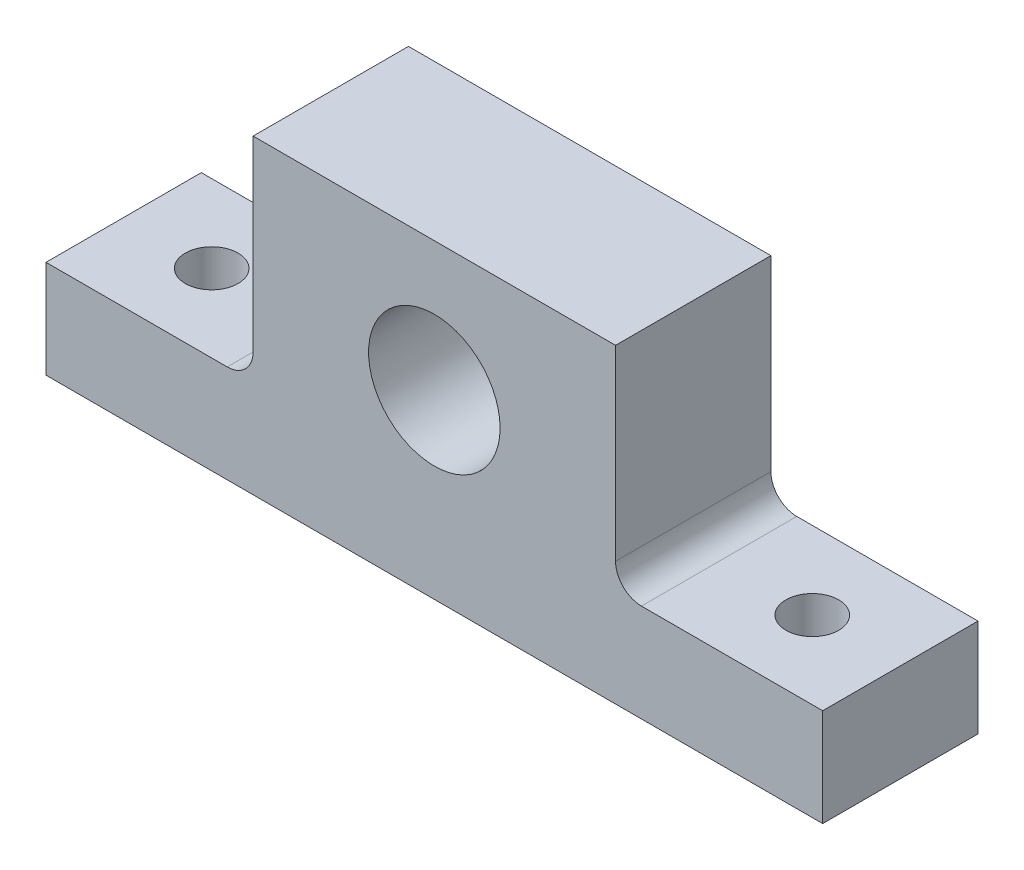
ISO-10303-21;
HEADER;
FILE_DESCRIPTION(('STEP AP214'),'2;1');
FILE_NAME('part.step','',(''),(''),'','','');
FILE_SCHEMA(('AUTOMOTIVE_DESIGN { 1 0 10303 214 1 1 1 1 }'));
ENDSEC;
DATA;
#1=APPLICATION_CONTEXT('core data for automotive mechanical design processes');
#2=APPLICATION_PROTOCOL_DEFINITION('international standard','automotive_design',2000,#1);
#3=PRODUCT_CONTEXT('',#1,'mechanical');
#4=PRODUCT('Part','Part','',(#3));
#5=PRODUCT_RELATED_PRODUCT_CATEGORY('part','',(#4));
#6=PRODUCT_DEFINITION_FORMATION('','',#4);
#7=PRODUCT_DEFINITION_CONTEXT('part definition',#1,'design');
#8=PRODUCT_DEFINITION('design','',#6,#7);
#9=PRODUCT_DEFINITION_SHAPE('','',#8);
#10=(LENGTH_UNIT() NAMED_UNIT(*) SI_UNIT(.MILLI.,.METRE.));
#11=(NAMED_UNIT(*) PLANE_ANGLE_UNIT() SI_UNIT($,.RADIAN.));
#12=(NAMED_UNIT(*) SI_UNIT($,.STERADIAN.) SOLID_ANGLE_UNIT());
#13=UNCERTAINTY_MEASURE_WITH_UNIT(LENGTH_MEASURE(1.E-05),#10,'distance_accuracy_value','');
#14=(GEOMETRIC_REPRESENTATION_CONTEXT(3) GLOBAL_UNCERTAINTY_ASSIGNED_CONTEXT((#13)) GLOBAL_UNIT_ASSIGNED_CONTEXT((#10,
#11,#12)) REPRESENTATION_CONTEXT('',''));
#15=CARTESIAN_POINT('',(0.,0.,0.));
#16=DIRECTION('',(0.,0.,1.));
#17=DIRECTION('',(1.,0.,0.));
#18=AXIS2_PLACEMENT_3D('',#15,#16,#17);
#19=CARTESIAN_POINT('',(-75.,-4.56980615594983,30.));
#20=DIRECTION('',(0.,-1.,0.));
#21=DIRECTION('',(1.,0.,0.));
#22=AXIS2_PLACEMENT_3D('',#19,#20,#21);
#23=PLANE('',#22);
#24=CARTESIAN_POINT('',(-58.,-4.56980615594983,15.));
#25=DIRECTION('',(0.,1.,0.));
#26=DIRECTION('',(0.,0.,1.));
#27=AXIS2_PLACEMENT_3D('',#24,#25,#26);
#28=CIRCLE('',#27,5.09999999999999);
#29=CARTESIAN_POINT('',(-58.,-4.56980615594983,20.1));
#30=VERTEX_POINT('',#29);
#31=EDGE_CURVE('E217',#30,#30,#28,.T.);
#32=ORIENTED_EDGE('',*,*,#31,.F.);
#33=EDGE_LOOP('',(#32));
#34=FACE_BOUND('',#33,.T.);
#35=DIRECTION('',(-1.,0.,0.));
#36=VECTOR('',#35,1.);
#37=CARTESIAN_POINT('',(-75.,-4.56980615594983,0.));
#38=LINE('',#37,#36);
#39=CARTESIAN_POINT('',(-40.,-4.56980615594983,0.));
#40=VERTEX_POINT('',#39);
#41=CARTESIAN_POINT('',(-75.,-4.56980615594983,0.));
#42=VERTEX_POINT('',#41);
#43=EDGE_CURVE('E143',#40,#42,#38,.T.);
#44=ORIENTED_EDGE('',*,*,#43,.T.);
#45=DIRECTION('',(0.,0.,-1.));
#46=VECTOR('',#45,1.);
#47=CARTESIAN_POINT('',(-75.,-4.56980615594983,30.));
#48=LINE('',#47,#46);
#49=CARTESIAN_POINT('',(-75.,-4.56980615594983,30.));
#50=VERTEX_POINT('',#49);
#51=EDGE_CURVE('E11',#50,#42,#48,.T.);
#52=ORIENTED_EDGE('',*,*,#51,.F.);
#53=DIRECTION('',(-1.,0.,0.));
#54=VECTOR('',#53,1.);
#55=CARTESIAN_POINT('',(-75.,-4.56980615594983,30.));
#56=LINE('',#55,#54);
#57=CARTESIAN_POINT('',(-40.,-4.56980615594983,30.));
#58=VERTEX_POINT('',#57);
#59=EDGE_CURVE('E162',#58,#50,#56,.T.);
#60=ORIENTED_EDGE('',*,*,#59,.F.);
#61=DIRECTION('',(0.,0.,-1.));
#62=VECTOR('',#61,1.);
#63=CARTESIAN_POINT('',(-40.,-4.56980615594983,30.));
#64=LINE('',#63,#62);
#65=EDGE_CURVE('E139',#58,#40,#64,.T.);
#66=ORIENTED_EDGE('',*,*,#65,.T.);
#67=EDGE_LOOP('',(#44,#52,#60,#66));
#68=FACE_BOUND('',#67,.T.);
#69=ADVANCED_FACE('F35',(#34,#68),#23,.F.);
#70=CARTESIAN_POINT('',(-75.,-23.4522409151327,30.));
#71=DIRECTION('',(1.,0.,0.));
#72=DIRECTION('',(0.,0.,-1.));
#73=AXIS2_PLACEMENT_3D('',#70,#71,#72);
#74=PLANE('',#73);
#75=DIRECTION('',(0.,-1.,0.));
#76=VECTOR('',#75,1.);
#77=CARTESIAN_POINT('',(-75.,-23.4522409151327,0.));
#78=LINE('',#77,#76);
#79=CARTESIAN_POINT('',(-75.,-23.4522409151327,0.));
#80=VERTEX_POINT('',#79);
#81=EDGE_CURVE('E146',#42,#80,#78,.T.);
#82=ORIENTED_EDGE('',*,*,#81,.T.);
#83=DIRECTION('',(0.,0.,-1.));
#84=VECTOR('',#83,1.);
#85=CARTESIAN_POINT('',(-75.,-23.4522409151327,30.));
#86=LINE('',#85,#84);
#87=CARTESIAN_POINT('',(-75.,-23.4522409151327,30.));
#88=VERTEX_POINT('',#87);
#89=EDGE_CURVE('E43',#88,#80,#86,.T.);
#90=ORIENTED_EDGE('',*,*,#89,.F.);
#91=DIRECTION('',(0.,-1.,0.));
#92=VECTOR('',#91,1.);
#93=CARTESIAN_POINT('',(-75.,-23.4522409151327,30.));
#94=LINE('',#93,#92);
#95=EDGE_CURVE('E100',#50,#88,#94,.T.);
#96=ORIENTED_EDGE('',*,*,#95,.F.);
#97=ORIENTED_EDGE('',*,*,#51,.T.);
#98=EDGE_LOOP('',(#82,#90,#96,#97));
#99=FACE_BOUND('',#98,.T.);
#100=ADVANCED_FACE('F242',(#99),#74,.F.);
#101=CARTESIAN_POINT('',(-75.,-23.4522409151327,30.));
#102=DIRECTION('',(0.,1.,0.));
#103=DIRECTION('',(0.,0.,1.));
#104=AXIS2_PLACEMENT_3D('',#101,#102,#103);
#105=PLANE('',#104);
#106=CARTESIAN_POINT('',(58.,-23.4522409151327,15.));
#107=DIRECTION('',(0.,1.,0.));
#108=DIRECTION('',(0.,0.,1.));
#109=AXIS2_PLACEMENT_3D('',#106,#107,#108);
#110=CIRCLE('',#109,5.09999999999999);
#111=CARTESIAN_POINT('',(58.,-23.4522409151327,20.1));
#112=VERTEX_POINT('',#111);
#113=EDGE_CURVE('E220',#112,#112,#110,.T.);
#114=ORIENTED_EDGE('',*,*,#113,.T.);
#115=EDGE_LOOP('',(#114));
#116=FACE_BOUND('',#115,.T.);
#117=CARTESIAN_POINT('',(-58.,-23.4522409151327,15.));
#118=DIRECTION('',(0.,1.,0.));
#119=DIRECTION('',(0.,0.,1.));
#120=AXIS2_PLACEMENT_3D('',#117,#118,#119);
#121=CIRCLE('',#120,5.09999999999999);
#122=CARTESIAN_POINT('',(-58.,-23.4522409151327,20.1));
#123=VERTEX_POINT('',#122);
#124=EDGE_CURVE('E214',#123,#123,#121,.T.);
#125=ORIENTED_EDGE('',*,*,#124,.T.);
#126=EDGE_LOOP('',(#125));
#127=FACE_BOUND('',#126,.T.);
#128=DIRECTION('',(1.,0.,0.));
#129=VECTOR('',#128,1.);
#130=CARTESIAN_POINT('',(-75.,-23.4522409151327,0.));
#131=LINE('',#130,#129);
#132=CARTESIAN_POINT('',(75.,-23.4522409151327,0.));
#133=VERTEX_POINT('',#132);
#134=EDGE_CURVE('E149',#80,#133,#131,.T.);
#135=ORIENTED_EDGE('',*,*,#134,.T.);
#136=DIRECTION('',(0.,0.,-1.));
#137=VECTOR('',#136,1.);
#138=CARTESIAN_POINT('',(75.,-23.4522409151327,30.));
#139=LINE('',#138,#137);
#140=CARTESIAN_POINT('',(75.,-23.4522409151327,30.));
#141=VERTEX_POINT('',#140);
#142=EDGE_CURVE('E175',#141,#133,#139,.T.);
#143=ORIENTED_EDGE('',*,*,#142,.F.);
#144=DIRECTION('',(1.,0.,0.));
#145=VECTOR('',#144,1.);
#146=CARTESIAN_POINT('',(-75.,-23.4522409151327,30.));
#147=LINE('',#146,#145);
#148=EDGE_CURVE('E183',#88,#141,#147,.T.);
#149=ORIENTED_EDGE('',*,*,#148,.F.);
#150=ORIENTED_EDGE('',*,*,#89,.T.);
#151=EDGE_LOOP('',(#135,#143,#149,#150));
#152=FACE_BOUND('',#151,.T.);
#153=ADVANCED_FACE('F181',(#116,#127,#152),#105,.F.);
#154=CARTESIAN_POINT('',(75.,-23.4522409151327,30.));
#155=DIRECTION('',(-1.,0.,0.));
#156=DIRECTION('',(0.,0.,1.));
#157=AXIS2_PLACEMENT_3D('',#154,#155,#156);
#158=PLANE('',#157);
#159=DIRECTION('',(0.,1.,0.));
#160=VECTOR('',#159,1.);
#161=CARTESIAN_POINT('',(75.,-23.4522409151327,0.));
#162=LINE('',#161,#160);
#163=CARTESIAN_POINT('',(75.,-4.56980615594981,0.));
#164=VERTEX_POINT('',#163);
#165=EDGE_CURVE('E151',#133,#164,#162,.T.);
#166=ORIENTED_EDGE('',*,*,#165,.T.);
#167=DIRECTION('',(0.,0.,-1.));
#168=VECTOR('',#167,1.);
#169=CARTESIAN_POINT('',(75.,-4.56980615594981,30.));
#170=LINE('',#169,#168);
#171=CARTESIAN_POINT('',(75.,-4.56980615594981,30.));
#172=VERTEX_POINT('',#171);
#173=EDGE_CURVE('E172',#172,#164,#170,.T.);
#174=ORIENTED_EDGE('',*,*,#173,.F.);
#175=DIRECTION('',(0.,1.,0.));
#176=VECTOR('',#175,1.);
#177=CARTESIAN_POINT('',(75.,-23.4522409151327,30.));
#178=LINE('',#177,#176);
#179=EDGE_CURVE('E201',#141,#172,#178,.T.);
#180=ORIENTED_EDGE('',*,*,#179,.F.);
#181=ORIENTED_EDGE('',*,*,#142,.T.);
#182=EDGE_LOOP('',(#166,#174,#180,#181));
#183=FACE_BOUND('',#182,.T.);
#184=ADVANCED_FACE('F192',(#183),#158,.F.);
#185=CARTESIAN_POINT('',(75.,-4.56980615594981,30.));
#186=DIRECTION('',(0.,-1.,0.));
#187=DIRECTION('',(1.,0.,0.));
#188=AXIS2_PLACEMENT_3D('',#185,#186,#187);
#189=PLANE('',#188);
#190=CARTESIAN_POINT('',(58.,-4.56980615594982,15.));
#191=DIRECTION('',(0.,1.,0.));
#192=DIRECTION('',(0.,0.,1.));
#193=AXIS2_PLACEMENT_3D('',#190,#191,#192);
#194=CIRCLE('',#193,5.09999999999999);
#195=CARTESIAN_POINT('',(58.,-4.56980615594982,20.1));
#196=VERTEX_POINT('',#195);
#197=EDGE_CURVE('E223',#196,#196,#194,.T.);
#198=ORIENTED_EDGE('',*,*,#197,.F.);
#199=EDGE_LOOP('',(#198));
#200=FACE_BOUND('',#199,.T.);
#201=DIRECTION('',(-1.,0.,0.));
#202=VECTOR('',#201,1.);
#203=CARTESIAN_POINT('',(75.,-4.56980615594981,0.));
#204=LINE('',#203,#202);
#205=CARTESIAN_POINT('',(40.,-4.56980615594982,0.));
#206=VERTEX_POINT('',#205);
#207=EDGE_CURVE('E153',#164,#206,#204,.T.);
#208=ORIENTED_EDGE('',*,*,#207,.T.);
#209=DIRECTION('',(0.,0.,-1.));
#210=VECTOR('',#209,1.);
#211=CARTESIAN_POINT('',(40.,-4.56980615594982,30.));
#212=LINE('',#211,#210);
#213=CARTESIAN_POINT('',(40.,-4.56980615594982,30.));
#214=VERTEX_POINT('',#213);
#215=EDGE_CURVE('E169',#214,#206,#212,.T.);
#216=ORIENTED_EDGE('',*,*,#215,.F.);
#217=DIRECTION('',(-1.,0.,0.));
#218=VECTOR('',#217,1.);
#219=CARTESIAN_POINT('',(75.,-4.56980615594981,30.));
#220=LINE('',#219,#218);
#221=EDGE_CURVE('E198',#172,#214,#220,.T.);
#222=ORIENTED_EDGE('',*,*,#221,.F.);
#223=ORIENTED_EDGE('',*,*,#173,.T.);
#224=EDGE_LOOP('',(#208,#216,#222,#223));
#225=FACE_BOUND('',#224,.T.);
#226=ADVANCED_FACE('F196',(#200,#225),#189,.F.);
#227=CARTESIAN_POINT('',(40.,0.430193844050182,30.));
#228=DIRECTION('',(0.,0.,-1.));
#229=DIRECTION('',(-1.,0.,0.));
#230=AXIS2_PLACEMENT_3D('',#227,#228,#229);
#231=CYLINDRICAL_SURFACE('',#230,5.);
#232=CARTESIAN_POINT('',(40.,0.430193844050182,0.));
#233=DIRECTION('',(0.,0.,-1.));
#234=DIRECTION('',(-1.,0.,0.));
#235=AXIS2_PLACEMENT_3D('',#232,#233,#234);
#236=CIRCLE('',#235,5.);
#237=CARTESIAN_POINT('',(35.,0.430193844050182,0.));
#238=VERTEX_POINT('',#237);
#239=EDGE_CURVE('E155',#206,#238,#236,.T.);
#240=ORIENTED_EDGE('',*,*,#239,.T.);
#241=DIRECTION('',(0.,0.,-1.));
#242=VECTOR('',#241,1.);
#243=CARTESIAN_POINT('',(35.,0.430193844050182,30.));
#244=LINE('',#243,#242);
#245=CARTESIAN_POINT('',(35.,0.430193844050182,30.));
#246=VERTEX_POINT('',#245);
#247=EDGE_CURVE('E166',#246,#238,#244,.T.);
#248=ORIENTED_EDGE('',*,*,#247,.F.);
#249=CARTESIAN_POINT('',(40.,0.430193844050182,30.));
#250=DIRECTION('',(0.,0.,-1.));
#251=DIRECTION('',(-1.,0.,0.));
#252=AXIS2_PLACEMENT_3D('',#249,#250,#251);
#253=CIRCLE('',#252,5.);
#254=EDGE_CURVE('E200',#214,#246,#253,.T.);
#255=ORIENTED_EDGE('',*,*,#254,.F.);
#256=ORIENTED_EDGE('',*,*,#215,.T.);
#257=EDGE_LOOP('',(#240,#248,#255,#256));
#258=FACE_BOUND('',#257,.T.);
#259=ADVANCED_FACE('F231',(#258),#231,.F.);
#260=CARTESIAN_POINT('',(35.,0.430193844050182,30.));
#261=DIRECTION('',(-1.,0.,0.));
#262=DIRECTION('',(0.,-1.,0.));
#263=AXIS2_PLACEMENT_3D('',#260,#261,#262);
#264=PLANE('',#263);
#265=DIRECTION('',(0.,1.,0.));
#266=VECTOR('',#265,1.);
#267=CARTESIAN_POINT('',(35.,0.430193844050182,0.));
#268=LINE('',#267,#266);
#269=CARTESIAN_POINT('',(35.,36.5477590848673,0.));
#270=VERTEX_POINT('',#269);
#271=EDGE_CURVE('E157',#238,#270,#268,.T.);
#272=ORIENTED_EDGE('',*,*,#271,.T.);
#273=DIRECTION('',(0.,0.,-1.));
#274=VECTOR('',#273,1.);
#275=CARTESIAN_POINT('',(35.,36.5477590848673,30.));
#276=LINE('',#275,#274);
#277=CARTESIAN_POINT('',(35.,36.5477590848673,30.));
#278=VERTEX_POINT('',#277);
#279=EDGE_CURVE('E134',#278,#270,#276,.T.);
#280=ORIENTED_EDGE('',*,*,#279,.F.);
#281=DIRECTION('',(0.,1.,0.));
#282=VECTOR('',#281,1.);
#283=CARTESIAN_POINT('',(35.,0.430193844050182,30.));
#284=LINE('',#283,#282);
#285=EDGE_CURVE('E125',#246,#278,#284,.T.);
#286=ORIENTED_EDGE('',*,*,#285,.F.);
#287=ORIENTED_EDGE('',*,*,#247,.T.);
#288=EDGE_LOOP('',(#272,#280,#286,#287));
#289=FACE_BOUND('',#288,.T.);
#290=ADVANCED_FACE('F237',(#289),#264,.F.);
#291=CARTESIAN_POINT('',(35.,36.5477590848673,30.));
#292=DIRECTION('',(0.,-1.,0.));
#293=DIRECTION('',(1.,0.,0.));
#294=AXIS2_PLACEMENT_3D('',#291,#292,#293);
#295=PLANE('',#294);
#296=DIRECTION('',(-1.,0.,0.));
#297=VECTOR('',#296,1.);
#298=CARTESIAN_POINT('',(35.,36.5477590848673,0.));
#299=LINE('',#298,#297);
#300=CARTESIAN_POINT('',(-35.,36.5477590848673,0.));
#301=VERTEX_POINT('',#300);
#302=EDGE_CURVE('E133',#270,#301,#299,.T.);
#303=ORIENTED_EDGE('',*,*,#302,.T.);
#304=DIRECTION('',(0.,0.,-1.));
#305=VECTOR('',#304,1.);
#306=CARTESIAN_POINT('',(-35.,36.5477590848673,30.));
#307=LINE('',#306,#305);
#308=CARTESIAN_POINT('',(-35.,36.5477590848673,30.));
#309=VERTEX_POINT('',#308);
#310=EDGE_CURVE('E130',#309,#301,#307,.T.);
#311=ORIENTED_EDGE('',*,*,#310,.F.);
#312=DIRECTION('',(-1.,0.,0.));
#313=VECTOR('',#312,1.);
#314=CARTESIAN_POINT('',(35.,36.5477590848673,30.));
#315=LINE('',#314,#313);
#316=EDGE_CURVE('E119',#278,#309,#315,.T.);
#317=ORIENTED_EDGE('',*,*,#316,.F.);
#318=ORIENTED_EDGE('',*,*,#279,.T.);
#319=EDGE_LOOP('',(#303,#311,#317,#318));
#320=FACE_BOUND('',#319,.T.);
#321=ADVANCED_FACE('F131',(#320),#295,.F.);
#322=CARTESIAN_POINT('',(-35.,0.430193844050173,30.));
#323=DIRECTION('',(1.,0.,0.));
#324=DIRECTION('',(0.,1.,0.));
#325=AXIS2_PLACEMENT_3D('',#322,#323,#324);
#326=PLANE('',#325);
#327=DIRECTION('',(0.,-1.,0.));
#328=VECTOR('',#327,1.);
#329=CARTESIAN_POINT('',(-35.,0.430193844050173,0.));
#330=LINE('',#329,#328);
#331=CARTESIAN_POINT('',(-35.,0.430193844050173,0.));
#332=VERTEX_POINT('',#331);
#333=EDGE_CURVE('E86',#301,#332,#330,.T.);
#334=ORIENTED_EDGE('',*,*,#333,.T.);
#335=DIRECTION('',(0.,0.,-1.));
#336=VECTOR('',#335,1.);
#337=CARTESIAN_POINT('',(-35.,0.430193844050173,30.));
#338=LINE('',#337,#336);
#339=CARTESIAN_POINT('',(-35.,0.430193844050173,30.));
#340=VERTEX_POINT('',#339);
#341=EDGE_CURVE('E135',#340,#332,#338,.T.);
#342=ORIENTED_EDGE('',*,*,#341,.F.);
#343=DIRECTION('',(0.,-1.,0.));
#344=VECTOR('',#343,1.);
#345=CARTESIAN_POINT('',(-35.,0.430193844050173,30.));
#346=LINE('',#345,#344);
#347=EDGE_CURVE('E123',#309,#340,#346,.T.);
#348=ORIENTED_EDGE('',*,*,#347,.F.);
#349=ORIENTED_EDGE('',*,*,#310,.T.);
#350=EDGE_LOOP('',(#334,#342,#348,#349));
#351=FACE_BOUND('',#350,.T.);
#352=ADVANCED_FACE('F137',(#351),#326,.F.);
#353=CARTESIAN_POINT('',(-40.,0.430193844050172,30.));
#354=DIRECTION('',(0.,0.,-1.));
#355=DIRECTION('',(-1.,0.,0.));
#356=AXIS2_PLACEMENT_3D('',#353,#354,#355);
#357=CYLINDRICAL_SURFACE('',#356,5.);
#358=CARTESIAN_POINT('',(-40.,0.430193844050172,0.));
#359=DIRECTION('',(0.,0.,-1.));
#360=DIRECTION('',(1.,0.,0.));
#361=AXIS2_PLACEMENT_3D('',#358,#359,#360);
#362=CIRCLE('',#361,5.);
#363=EDGE_CURVE('E92',#332,#40,#362,.T.);
#364=ORIENTED_EDGE('',*,*,#363,.T.);
#365=ORIENTED_EDGE('',*,*,#65,.F.);
#366=CARTESIAN_POINT('',(-40.,0.430193844050172,30.));
#367=DIRECTION('',(0.,0.,-1.));
#368=DIRECTION('',(1.,0.,0.));
#369=AXIS2_PLACEMENT_3D('',#366,#367,#368);
#370=CIRCLE('',#369,5.);
#371=EDGE_CURVE('E51',#340,#58,#370,.T.);
#372=ORIENTED_EDGE('',*,*,#371,.F.);
#373=ORIENTED_EDGE('',*,*,#341,.T.);
#374=EDGE_LOOP('',(#364,#365,#372,#373));
#375=FACE_BOUND('',#374,.T.);
#376=ADVANCED_FACE('F263',(#375),#357,.F.);
#377=CARTESIAN_POINT('',(-40.,0.430193844050172,30.));
#378=DIRECTION('',(0.,0.,1.));
#379=DIRECTION('',(1.,0.,0.));
#380=AXIS2_PLACEMENT_3D('',#377,#378,#379);
#381=PLANE('',#380);
#382=CARTESIAN_POINT('',(0.,11.5477590848673,30.));
#383=DIRECTION('',(0.,0.,1.));
#384=DIRECTION('',(1.,0.,0.));
#385=AXIS2_PLACEMENT_3D('',#382,#383,#384);
#386=CIRCLE('',#385,12.7);
#387=CARTESIAN_POINT('',(12.7,11.5477590848673,30.));
#388=VERTEX_POINT('',#387);
#389=EDGE_CURVE('E211',#388,#388,#386,.T.);
#390=ORIENTED_EDGE('',*,*,#389,.F.);
#391=EDGE_LOOP('',(#390));
#392=FACE_BOUND('',#391,.T.);
#393=ORIENTED_EDGE('',*,*,#59,.T.);
#394=ORIENTED_EDGE('',*,*,#95,.T.);
#395=ORIENTED_EDGE('',*,*,#148,.T.);
#396=ORIENTED_EDGE('',*,*,#179,.T.);
#397=ORIENTED_EDGE('',*,*,#221,.T.);
#398=ORIENTED_EDGE('',*,*,#254,.T.);
#399=ORIENTED_EDGE('',*,*,#285,.T.);
#400=ORIENTED_EDGE('',*,*,#316,.T.);
#401=ORIENTED_EDGE('',*,*,#347,.T.);
#402=ORIENTED_EDGE('',*,*,#371,.T.);
#403=EDGE_LOOP('',(#393,#394,#395,#396,#397,#398,#399,#400,#401,#402));
#404=FACE_BOUND('',#403,.T.);
#405=ADVANCED_FACE('F121',(#392,#404),#381,.T.);
#406=CARTESIAN_POINT('',(-40.,0.430193844050172,0.));
#407=DIRECTION('',(0.,0.,1.));
#408=DIRECTION('',(1.,0.,0.));
#409=AXIS2_PLACEMENT_3D('',#406,#407,#408);
#410=PLANE('',#409);
#411=CARTESIAN_POINT('',(0.,11.5477590848673,0.));
#412=DIRECTION('',(0.,0.,1.));
#413=DIRECTION('',(1.,0.,0.));
#414=AXIS2_PLACEMENT_3D('',#411,#412,#413);
#415=CIRCLE('',#414,12.7);
#416=CARTESIAN_POINT('',(12.7,11.5477590848673,0.));
#417=VERTEX_POINT('',#416);
#418=EDGE_CURVE('E147',#417,#417,#415,.T.);
#419=ORIENTED_EDGE('',*,*,#418,.T.);
#420=EDGE_LOOP('',(#419));
#421=FACE_BOUND('',#420,.T.);
#422=ORIENTED_EDGE('',*,*,#43,.F.);
#423=ORIENTED_EDGE('',*,*,#363,.F.);
#424=ORIENTED_EDGE('',*,*,#333,.F.);
#425=ORIENTED_EDGE('',*,*,#302,.F.);
#426=ORIENTED_EDGE('',*,*,#271,.F.);
#427=ORIENTED_EDGE('',*,*,#239,.F.);
#428=ORIENTED_EDGE('',*,*,#207,.F.);
#429=ORIENTED_EDGE('',*,*,#165,.F.);
#430=ORIENTED_EDGE('',*,*,#134,.F.);
#431=ORIENTED_EDGE('',*,*,#81,.F.);
#432=EDGE_LOOP('',(#422,#423,#424,#425,#426,#427,#428,#429,#430,#431));
#433=FACE_BOUND('',#432,.T.);
#434=ADVANCED_FACE('F187',(#421,#433),#410,.F.);
#435=CARTESIAN_POINT('',(0.,11.5477590848673,30.));
#436=DIRECTION('',(0.,0.,1.));
#437=DIRECTION('',(1.,0.,0.));
#438=AXIS2_PLACEMENT_3D('',#435,#436,#437);
#439=CYLINDRICAL_SURFACE('',#438,12.7);
#440=ORIENTED_EDGE('',*,*,#418,.F.);
#441=EDGE_LOOP('',(#440));
#442=FACE_BOUND('',#441,.T.);
#443=ORIENTED_EDGE('',*,*,#389,.T.);
#444=EDGE_LOOP('',(#443));
#445=FACE_BOUND('',#444,.T.);
#446=ADVANCED_FACE('F268',(#442,#445),#439,.F.);
#447=CARTESIAN_POINT('',(-58.,-4.56980615594983,15.));
#448=DIRECTION('',(0.,1.,0.));
#449=DIRECTION('',(0.,0.,1.));
#450=AXIS2_PLACEMENT_3D('',#447,#448,#449);
#451=CYLINDRICAL_SURFACE('',#450,5.09999999999999);
#452=ORIENTED_EDGE('',*,*,#31,.T.);
#453=EDGE_LOOP('',(#452));
#454=FACE_BOUND('',#453,.T.);
#455=ORIENTED_EDGE('',*,*,#124,.F.);
#456=EDGE_LOOP('',(#455));
#457=FACE_BOUND('',#456,.T.);
#458=ADVANCED_FACE('F275',(#454,#457),#451,.F.);
#459=CARTESIAN_POINT('',(58.,-4.56980615594982,15.));
#460=DIRECTION('',(0.,1.,0.));
#461=DIRECTION('',(0.,0.,1.));
#462=AXIS2_PLACEMENT_3D('',#459,#460,#461);
#463=CYLINDRICAL_SURFACE('',#462,5.09999999999999);
#464=ORIENTED_EDGE('',*,*,#197,.T.);
#465=EDGE_LOOP('',(#464));
#466=FACE_BOUND('',#465,.T.);
#467=ORIENTED_EDGE('',*,*,#113,.F.);
#468=EDGE_LOOP('',(#467));
#469=FACE_BOUND('',#468,.T.);
#470=ADVANCED_FACE('F227',(#466,#469),#463,.F.);
#471=CLOSED_SHELL('',(#69,#100,#153,#184,#226,#259,#290,#321,#352,#376,#405,#434,#446,#458,#470));
#472=MANIFOLD_SOLID_BREP('B2',#471);
#473=ADVANCED_BREP_SHAPE_REPRESENTATION('',(#18,#472),#14);
#474=SHAPE_DEFINITION_REPRESENTATION(#9,#473);
ENDSEC;
END-ISO-10303-21;
